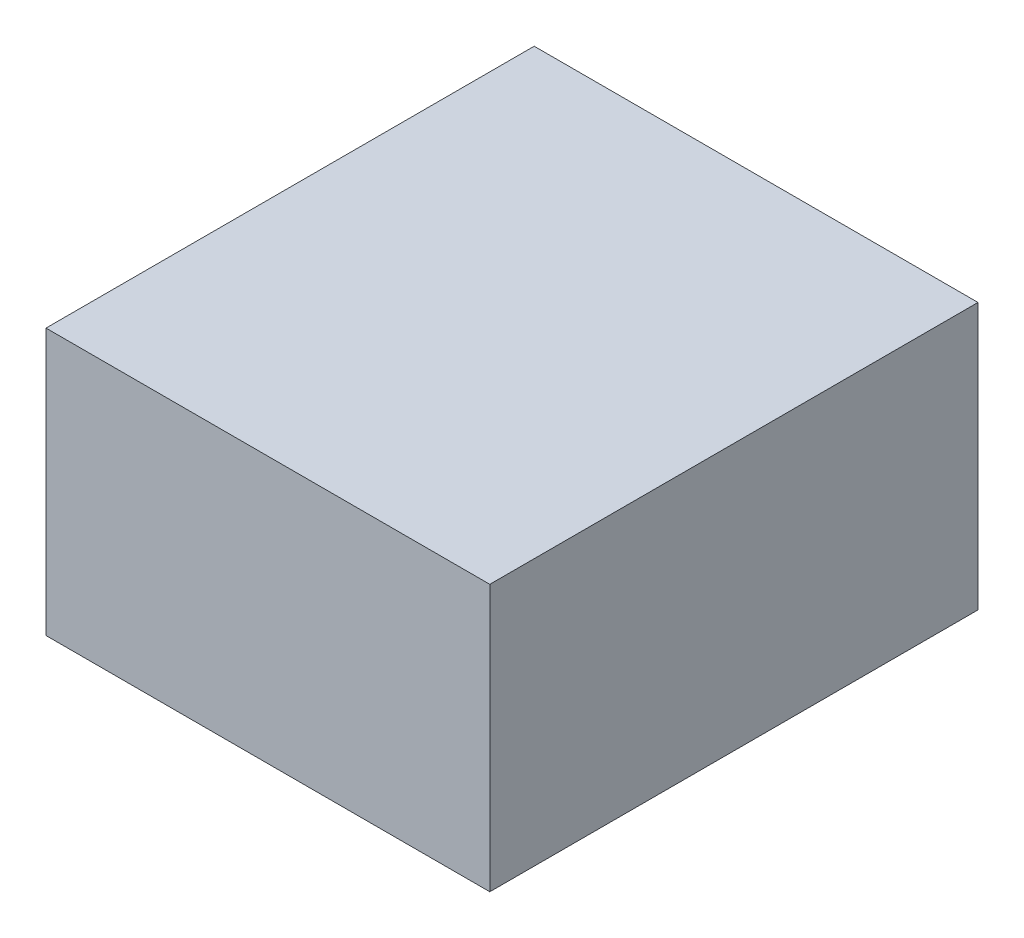
ISO-10303-21;
HEADER;
FILE_DESCRIPTION(('STEP AP214'),'2;1');
FILE_NAME('part.step','',(''),(''),'','','');
FILE_SCHEMA(('AUTOMOTIVE_DESIGN { 1 0 10303 214 1 1 1 1 }'));
ENDSEC;
DATA;
#1=APPLICATION_CONTEXT('core data for automotive mechanical design processes');
#2=APPLICATION_PROTOCOL_DEFINITION('international standard','automotive_design',2000,#1);
#3=PRODUCT_CONTEXT('',#1,'mechanical');
#4=PRODUCT('Part','Part','',(#3));
#5=PRODUCT_RELATED_PRODUCT_CATEGORY('part','',(#4));
#6=PRODUCT_DEFINITION_FORMATION('','',#4);
#7=PRODUCT_DEFINITION_CONTEXT('part definition',#1,'design');
#8=PRODUCT_DEFINITION('design','',#6,#7);
#9=PRODUCT_DEFINITION_SHAPE('','',#8);
#10=(LENGTH_UNIT() NAMED_UNIT(*) SI_UNIT(.MILLI.,.METRE.));
#11=(NAMED_UNIT(*) PLANE_ANGLE_UNIT() SI_UNIT($,.RADIAN.));
#12=(NAMED_UNIT(*) SI_UNIT($,.STERADIAN.) SOLID_ANGLE_UNIT());
#13=UNCERTAINTY_MEASURE_WITH_UNIT(LENGTH_MEASURE(1.E-05),#10,'distance_accuracy_value','');
#14=(GEOMETRIC_REPRESENTATION_CONTEXT(3) GLOBAL_UNCERTAINTY_ASSIGNED_CONTEXT((#13)) GLOBAL_UNIT_ASSIGNED_CONTEXT((#10,
#11,#12)) REPRESENTATION_CONTEXT('',''));
#15=CARTESIAN_POINT('',(0.,0.,0.));
#16=DIRECTION('',(0.,0.,1.));
#17=DIRECTION('',(1.,0.,0.));
#18=AXIS2_PLACEMENT_3D('',#15,#16,#17);
#19=CARTESIAN_POINT('',(50.,30.,110.));
#20=DIRECTION('',(-1.,0.,0.));
#21=DIRECTION('',(0.,-1.,0.));
#22=AXIS2_PLACEMENT_3D('',#19,#20,#21);
#23=PLANE('',#22);
#24=DIRECTION('',(0.,1.,0.));
#25=VECTOR('',#24,1.);
#26=CARTESIAN_POINT('',(50.,30.,0.));
#27=LINE('',#26,#25);
#28=CARTESIAN_POINT('',(50.,-30.,0.));
#29=VERTEX_POINT('',#28);
#30=CARTESIAN_POINT('',(50.,30.,0.));
#31=VERTEX_POINT('',#30);
#32=EDGE_CURVE('E107',#29,#31,#27,.T.);
#33=ORIENTED_EDGE('',*,*,#32,.T.);
#34=DIRECTION('',(0.,0.,-1.));
#35=VECTOR('',#34,1.);
#36=CARTESIAN_POINT('',(50.,30.,110.));
#37=LINE('',#36,#35);
#38=CARTESIAN_POINT('',(50.,30.,110.));
#39=VERTEX_POINT('',#38);
#40=EDGE_CURVE('E11',#39,#31,#37,.T.);
#41=ORIENTED_EDGE('',*,*,#40,.F.);
#42=DIRECTION('',(0.,1.,0.));
#43=VECTOR('',#42,1.);
#44=CARTESIAN_POINT('',(50.,30.,110.));
#45=LINE('',#44,#43);
#46=CARTESIAN_POINT('',(50.,-30.,110.));
#47=VERTEX_POINT('',#46);
#48=EDGE_CURVE('E91',#47,#39,#45,.T.);
#49=ORIENTED_EDGE('',*,*,#48,.F.);
#50=DIRECTION('',(0.,0.,-1.));
#51=VECTOR('',#50,1.);
#52=CARTESIAN_POINT('',(50.,-30.,110.));
#53=LINE('',#52,#51);
#54=EDGE_CURVE('E103',#47,#29,#53,.T.);
#55=ORIENTED_EDGE('',*,*,#54,.T.);
#56=EDGE_LOOP('',(#33,#41,#49,#55));
#57=FACE_BOUND('',#56,.T.);
#58=ADVANCED_FACE('F39',(#57),#23,.F.);
#59=CARTESIAN_POINT('',(-50.,30.,110.));
#60=DIRECTION('',(0.,-1.,0.));
#61=DIRECTION('',(0.,0.,-1.));
#62=AXIS2_PLACEMENT_3D('',#59,#60,#61);
#63=PLANE('',#62);
#64=DIRECTION('',(-1.,0.,0.));
#65=VECTOR('',#64,1.);
#66=CARTESIAN_POINT('',(-50.,30.,0.));
#67=LINE('',#66,#65);
#68=CARTESIAN_POINT('',(-50.,30.,0.));
#69=VERTEX_POINT('',#68);
#70=EDGE_CURVE('E96',#31,#69,#67,.T.);
#71=ORIENTED_EDGE('',*,*,#70,.T.);
#72=DIRECTION('',(0.,0.,-1.));
#73=VECTOR('',#72,1.);
#74=CARTESIAN_POINT('',(-50.,30.,110.));
#75=LINE('',#74,#73);
#76=CARTESIAN_POINT('',(-50.,30.,110.));
#77=VERTEX_POINT('',#76);
#78=EDGE_CURVE('E48',#77,#69,#75,.T.);
#79=ORIENTED_EDGE('',*,*,#78,.F.);
#80=DIRECTION('',(-1.,0.,0.));
#81=VECTOR('',#80,1.);
#82=CARTESIAN_POINT('',(-50.,30.,110.));
#83=LINE('',#82,#81);
#84=EDGE_CURVE('E86',#39,#77,#83,.T.);
#85=ORIENTED_EDGE('',*,*,#84,.F.);
#86=ORIENTED_EDGE('',*,*,#40,.T.);
#87=EDGE_LOOP('',(#71,#79,#85,#86));
#88=FACE_BOUND('',#87,.T.);
#89=ADVANCED_FACE('F95',(#88),#63,.F.);
#90=CARTESIAN_POINT('',(-50.,30.,110.));
#91=DIRECTION('',(1.,0.,0.));
#92=DIRECTION('',(0.,1.,0.));
#93=AXIS2_PLACEMENT_3D('',#90,#91,#92);
#94=PLANE('',#93);
#95=DIRECTION('',(0.,-1.,0.));
#96=VECTOR('',#95,1.);
#97=CARTESIAN_POINT('',(-50.,30.,0.));
#98=LINE('',#97,#96);
#99=CARTESIAN_POINT('',(-50.,-30.,0.));
#100=VERTEX_POINT('',#99);
#101=EDGE_CURVE('E73',#69,#100,#98,.T.);
#102=ORIENTED_EDGE('',*,*,#101,.T.);
#103=DIRECTION('',(0.,0.,-1.));
#104=VECTOR('',#103,1.);
#105=CARTESIAN_POINT('',(-50.,-30.,110.));
#106=LINE('',#105,#104);
#107=CARTESIAN_POINT('',(-50.,-30.,110.));
#108=VERTEX_POINT('',#107);
#109=EDGE_CURVE('E98',#108,#100,#106,.T.);
#110=ORIENTED_EDGE('',*,*,#109,.F.);
#111=DIRECTION('',(0.,-1.,0.));
#112=VECTOR('',#111,1.);
#113=CARTESIAN_POINT('',(-50.,30.,110.));
#114=LINE('',#113,#112);
#115=EDGE_CURVE('E89',#77,#108,#114,.T.);
#116=ORIENTED_EDGE('',*,*,#115,.F.);
#117=ORIENTED_EDGE('',*,*,#78,.T.);
#118=EDGE_LOOP('',(#102,#110,#116,#117));
#119=FACE_BOUND('',#118,.T.);
#120=ADVANCED_FACE('F99',(#119),#94,.F.);
#121=CARTESIAN_POINT('',(-50.,-30.,110.));
#122=DIRECTION('',(0.,1.,0.));
#123=DIRECTION('',(0.,0.,1.));
#124=AXIS2_PLACEMENT_3D('',#121,#122,#123);
#125=PLANE('',#124);
#126=DIRECTION('',(1.,0.,0.));
#127=VECTOR('',#126,1.);
#128=CARTESIAN_POINT('',(-50.,-30.,0.));
#129=LINE('',#128,#127);
#130=EDGE_CURVE('E79',#100,#29,#129,.T.);
#131=ORIENTED_EDGE('',*,*,#130,.T.);
#132=ORIENTED_EDGE('',*,*,#54,.F.);
#133=DIRECTION('',(1.,0.,0.));
#134=VECTOR('',#133,1.);
#135=CARTESIAN_POINT('',(-50.,-30.,110.));
#136=LINE('',#135,#134);
#137=EDGE_CURVE('E56',#108,#47,#136,.T.);
#138=ORIENTED_EDGE('',*,*,#137,.F.);
#139=ORIENTED_EDGE('',*,*,#109,.T.);
#140=EDGE_LOOP('',(#131,#132,#138,#139));
#141=FACE_BOUND('',#140,.T.);
#142=ADVANCED_FACE('F120',(#141),#125,.F.);
#143=CARTESIAN_POINT('',(0.,0.,110.));
#144=DIRECTION('',(0.,0.,1.));
#145=DIRECTION('',(1.,0.,0.));
#146=AXIS2_PLACEMENT_3D('',#143,#144,#145);
#147=PLANE('',#146);
#148=ORIENTED_EDGE('',*,*,#48,.T.);
#149=ORIENTED_EDGE('',*,*,#84,.T.);
#150=ORIENTED_EDGE('',*,*,#115,.T.);
#151=ORIENTED_EDGE('',*,*,#137,.T.);
#152=EDGE_LOOP('',(#148,#149,#150,#151));
#153=FACE_BOUND('',#152,.T.);
#154=ADVANCED_FACE('F87',(#153),#147,.T.);
#155=CARTESIAN_POINT('',(0.,0.,0.));
#156=DIRECTION('',(0.,0.,1.));
#157=DIRECTION('',(1.,0.,0.));
#158=AXIS2_PLACEMENT_3D('',#155,#156,#157);
#159=PLANE('',#158);
#160=ORIENTED_EDGE('',*,*,#32,.F.);
#161=ORIENTED_EDGE('',*,*,#130,.F.);
#162=ORIENTED_EDGE('',*,*,#101,.F.);
#163=ORIENTED_EDGE('',*,*,#70,.F.);
#164=EDGE_LOOP('',(#160,#161,#162,#163));
#165=FACE_BOUND('',#164,.T.);
#166=ADVANCED_FACE('F123',(#165),#159,.F.);
#167=CLOSED_SHELL('',(#58,#89,#120,#142,#154,#166));
#168=MANIFOLD_SOLID_BREP('B2',#167);
#169=ADVANCED_BREP_SHAPE_REPRESENTATION('',(#18,#168),#14);
#170=SHAPE_DEFINITION_REPRESENTATION(#9,#169);
ENDSEC;
END-ISO-10303-21;
